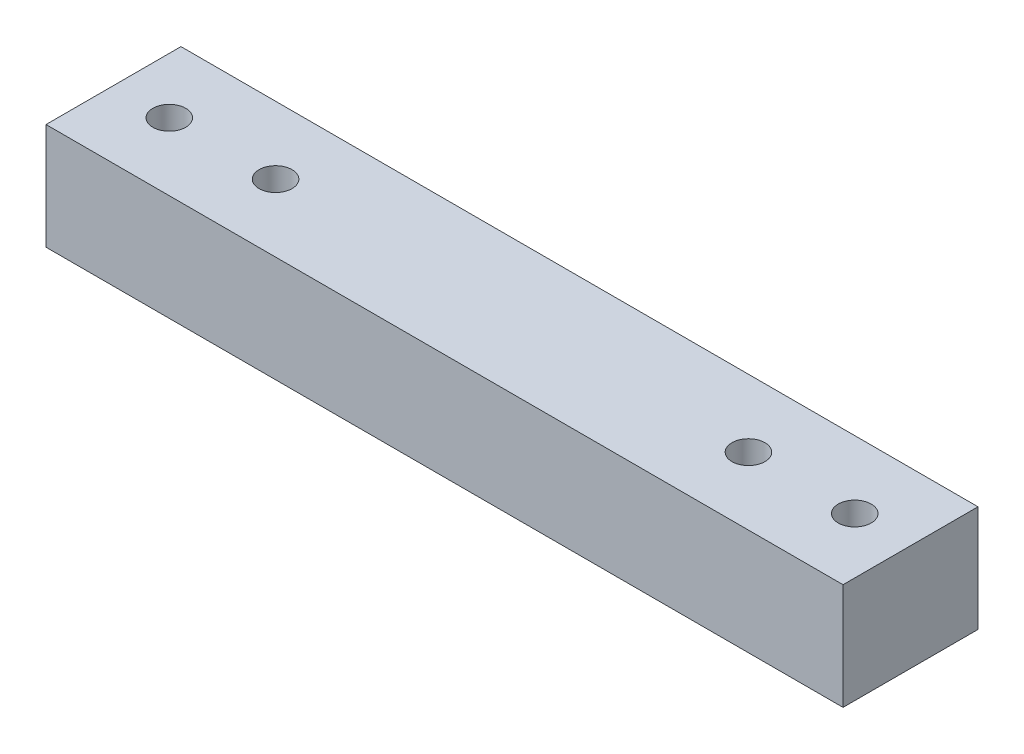
ISO-10303-21;
HEADER;
FILE_DESCRIPTION(('STEP AP214'),'2;1');
FILE_NAME('part.step','',(''),(''),'','','');
FILE_SCHEMA(('AUTOMOTIVE_DESIGN { 1 0 10303 214 1 1 1 1 }'));
ENDSEC;
DATA;
#1=APPLICATION_CONTEXT('core data for automotive mechanical design processes');
#2=APPLICATION_PROTOCOL_DEFINITION('international standard','automotive_design',2000,#1);
#3=PRODUCT_CONTEXT('',#1,'mechanical');
#4=PRODUCT('Part','Part','',(#3));
#5=PRODUCT_RELATED_PRODUCT_CATEGORY('part','',(#4));
#6=PRODUCT_DEFINITION_FORMATION('','',#4);
#7=PRODUCT_DEFINITION_CONTEXT('part definition',#1,'design');
#8=PRODUCT_DEFINITION('design','',#6,#7);
#9=PRODUCT_DEFINITION_SHAPE('','',#8);
#10=(LENGTH_UNIT() NAMED_UNIT(*) SI_UNIT(.MILLI.,.METRE.));
#11=(NAMED_UNIT(*) PLANE_ANGLE_UNIT() SI_UNIT($,.RADIAN.));
#12=(NAMED_UNIT(*) SI_UNIT($,.STERADIAN.) SOLID_ANGLE_UNIT());
#13=UNCERTAINTY_MEASURE_WITH_UNIT(LENGTH_MEASURE(1.E-05),#10,'distance_accuracy_value','');
#14=(GEOMETRIC_REPRESENTATION_CONTEXT(3) GLOBAL_UNCERTAINTY_ASSIGNED_CONTEXT((#13)) GLOBAL_UNIT_ASSIGNED_CONTEXT((#10,
#11,#12)) REPRESENTATION_CONTEXT('',''));
#15=CARTESIAN_POINT('',(0.,0.,0.));
#16=DIRECTION('',(0.,0.,1.));
#17=DIRECTION('',(1.,0.,0.));
#18=AXIS2_PLACEMENT_3D('',#15,#16,#17);
#19=CARTESIAN_POINT('',(37.5,10.,6.35));
#20=DIRECTION('',(-1.,0.,0.));
#21=DIRECTION('',(0.,0.,1.));
#22=AXIS2_PLACEMENT_3D('',#19,#20,#21);
#23=PLANE('',#22);
#24=DIRECTION('',(0.,0.,-1.));
#25=VECTOR('',#24,1.);
#26=CARTESIAN_POINT('',(37.5,0.,6.35));
#27=LINE('',#26,#25);
#28=CARTESIAN_POINT('',(37.5,0.,6.35));
#29=VERTEX_POINT('',#28);
#30=CARTESIAN_POINT('',(37.5,0.,-6.35));
#31=VERTEX_POINT('',#30);
#32=EDGE_CURVE('E107',#29,#31,#27,.T.);
#33=ORIENTED_EDGE('',*,*,#32,.T.);
#34=DIRECTION('',(0.,-1.,0.));
#35=VECTOR('',#34,1.);
#36=CARTESIAN_POINT('',(37.5,10.,-6.35));
#37=LINE('',#36,#35);
#38=CARTESIAN_POINT('',(37.5,10.,-6.35));
#39=VERTEX_POINT('',#38);
#40=EDGE_CURVE('E11',#39,#31,#37,.T.);
#41=ORIENTED_EDGE('',*,*,#40,.F.);
#42=DIRECTION('',(0.,0.,-1.));
#43=VECTOR('',#42,1.);
#44=CARTESIAN_POINT('',(37.5,10.,6.35));
#45=LINE('',#44,#43);
#46=CARTESIAN_POINT('',(37.5,10.,6.35));
#47=VERTEX_POINT('',#46);
#48=EDGE_CURVE('E95',#47,#39,#45,.T.);
#49=ORIENTED_EDGE('',*,*,#48,.F.);
#50=DIRECTION('',(0.,-1.,0.));
#51=VECTOR('',#50,1.);
#52=CARTESIAN_POINT('',(37.5,10.,6.35));
#53=LINE('',#52,#51);
#54=EDGE_CURVE('E103',#47,#29,#53,.T.);
#55=ORIENTED_EDGE('',*,*,#54,.T.);
#56=EDGE_LOOP('',(#33,#41,#49,#55));
#57=FACE_BOUND('',#56,.T.);
#58=ADVANCED_FACE('F44',(#57),#23,.F.);
#59=CARTESIAN_POINT('',(-37.5,10.,-6.35));
#60=DIRECTION('',(0.,0.,1.));
#61=DIRECTION('',(1.,0.,0.));
#62=AXIS2_PLACEMENT_3D('',#59,#60,#61);
#63=PLANE('',#62);
#64=DIRECTION('',(-1.,0.,0.));
#65=VECTOR('',#64,1.);
#66=CARTESIAN_POINT('',(-37.5,0.,-6.35));
#67=LINE('',#66,#65);
#68=CARTESIAN_POINT('',(-37.5,0.,-6.35));
#69=VERTEX_POINT('',#68);
#70=EDGE_CURVE('E99',#31,#69,#67,.T.);
#71=ORIENTED_EDGE('',*,*,#70,.T.);
#72=DIRECTION('',(0.,-1.,0.));
#73=VECTOR('',#72,1.);
#74=CARTESIAN_POINT('',(-37.5,10.,-6.35));
#75=LINE('',#74,#73);
#76=CARTESIAN_POINT('',(-37.5,10.,-6.35));
#77=VERTEX_POINT('',#76);
#78=EDGE_CURVE('E52',#77,#69,#75,.T.);
#79=ORIENTED_EDGE('',*,*,#78,.F.);
#80=DIRECTION('',(-1.,0.,0.));
#81=VECTOR('',#80,1.);
#82=CARTESIAN_POINT('',(-37.5,10.,-6.35));
#83=LINE('',#82,#81);
#84=EDGE_CURVE('E90',#39,#77,#83,.T.);
#85=ORIENTED_EDGE('',*,*,#84,.F.);
#86=ORIENTED_EDGE('',*,*,#40,.T.);
#87=EDGE_LOOP('',(#71,#79,#85,#86));
#88=FACE_BOUND('',#87,.T.);
#89=ADVANCED_FACE('F98',(#88),#63,.F.);
#90=CARTESIAN_POINT('',(-37.5,10.,6.35));
#91=DIRECTION('',(1.,0.,0.));
#92=DIRECTION('',(0.,0.,-1.));
#93=AXIS2_PLACEMENT_3D('',#90,#91,#92);
#94=PLANE('',#93);
#95=DIRECTION('',(0.,0.,1.));
#96=VECTOR('',#95,1.);
#97=CARTESIAN_POINT('',(-37.5,0.,6.35));
#98=LINE('',#97,#96);
#99=CARTESIAN_POINT('',(-37.5,0.,6.35));
#100=VERTEX_POINT('',#99);
#101=EDGE_CURVE('E77',#69,#100,#98,.T.);
#102=ORIENTED_EDGE('',*,*,#101,.T.);
#103=DIRECTION('',(0.,-1.,0.));
#104=VECTOR('',#103,1.);
#105=CARTESIAN_POINT('',(-37.5,10.,6.35));
#106=LINE('',#105,#104);
#107=CARTESIAN_POINT('',(-37.5,10.,6.35));
#108=VERTEX_POINT('',#107);
#109=EDGE_CURVE('E100',#108,#100,#106,.T.);
#110=ORIENTED_EDGE('',*,*,#109,.F.);
#111=DIRECTION('',(0.,0.,1.));
#112=VECTOR('',#111,1.);
#113=CARTESIAN_POINT('',(-37.5,10.,6.35));
#114=LINE('',#113,#112);
#115=EDGE_CURVE('E93',#77,#108,#114,.T.);
#116=ORIENTED_EDGE('',*,*,#115,.F.);
#117=ORIENTED_EDGE('',*,*,#78,.T.);
#118=EDGE_LOOP('',(#102,#110,#116,#117));
#119=FACE_BOUND('',#118,.T.);
#120=ADVANCED_FACE('F101',(#119),#94,.F.);
#121=CARTESIAN_POINT('',(-37.5,10.,6.35));
#122=DIRECTION('',(0.,0.,-1.));
#123=DIRECTION('',(-1.,0.,0.));
#124=AXIS2_PLACEMENT_3D('',#121,#122,#123);
#125=PLANE('',#124);
#126=DIRECTION('',(1.,0.,0.));
#127=VECTOR('',#126,1.);
#128=CARTESIAN_POINT('',(-37.5,0.,6.35));
#129=LINE('',#128,#127);
#130=EDGE_CURVE('E83',#100,#29,#129,.T.);
#131=ORIENTED_EDGE('',*,*,#130,.T.);
#132=ORIENTED_EDGE('',*,*,#54,.F.);
#133=DIRECTION('',(1.,0.,0.));
#134=VECTOR('',#133,1.);
#135=CARTESIAN_POINT('',(-37.5,10.,6.35));
#136=LINE('',#135,#134);
#137=EDGE_CURVE('E60',#108,#47,#136,.T.);
#138=ORIENTED_EDGE('',*,*,#137,.F.);
#139=ORIENTED_EDGE('',*,*,#109,.T.);
#140=EDGE_LOOP('',(#131,#132,#138,#139));
#141=FACE_BOUND('',#140,.T.);
#142=ADVANCED_FACE('F115',(#141),#125,.F.);
#143=CARTESIAN_POINT('',(0.,10.,0.));
#144=DIRECTION('',(0.,-1.,0.));
#145=DIRECTION('',(0.,0.,-1.));
#146=AXIS2_PLACEMENT_3D('',#143,#144,#145);
#147=PLANE('',#146);
#148=CARTESIAN_POINT('',(32.25,10.,0.));
#149=DIRECTION('',(0.,1.,0.));
#150=DIRECTION('',(0.,0.,1.));
#151=AXIS2_PLACEMENT_3D('',#148,#149,#150);
#152=CIRCLE('',#151,1.55);
#153=CARTESIAN_POINT('',(32.25,10.,1.55));
#154=VERTEX_POINT('',#153);
#155=EDGE_CURVE('E134',#154,#154,#152,.T.);
#156=ORIENTED_EDGE('',*,*,#155,.F.);
#157=EDGE_LOOP('',(#156));
#158=FACE_BOUND('',#157,.T.);
#159=CARTESIAN_POINT('',(-22.25,10.,0.));
#160=DIRECTION('',(0.,1.,0.));
#161=DIRECTION('',(0.,0.,-1.));
#162=AXIS2_PLACEMENT_3D('',#159,#160,#161);
#163=CIRCLE('',#162,1.55);
#164=CARTESIAN_POINT('',(-22.25,10.,-1.55));
#165=VERTEX_POINT('',#164);
#166=EDGE_CURVE('E125',#165,#165,#163,.T.);
#167=ORIENTED_EDGE('',*,*,#166,.F.);
#168=EDGE_LOOP('',(#167));
#169=FACE_BOUND('',#168,.T.);
#170=CARTESIAN_POINT('',(-32.25,10.,0.));
#171=DIRECTION('',(0.,1.,0.));
#172=DIRECTION('',(0.,0.,-1.));
#173=AXIS2_PLACEMENT_3D('',#170,#171,#172);
#174=CIRCLE('',#173,1.55);
#175=CARTESIAN_POINT('',(-32.25,10.,-1.55));
#176=VERTEX_POINT('',#175);
#177=EDGE_CURVE('E124',#176,#176,#174,.T.);
#178=ORIENTED_EDGE('',*,*,#177,.F.);
#179=EDGE_LOOP('',(#178));
#180=FACE_BOUND('',#179,.T.);
#181=CARTESIAN_POINT('',(22.25,10.,0.));
#182=DIRECTION('',(0.,1.,0.));
#183=DIRECTION('',(0.,0.,1.));
#184=AXIS2_PLACEMENT_3D('',#181,#182,#183);
#185=CIRCLE('',#184,1.55);
#186=CARTESIAN_POINT('',(22.25,10.,1.55));
#187=VERTEX_POINT('',#186);
#188=EDGE_CURVE('E131',#187,#187,#185,.T.);
#189=ORIENTED_EDGE('',*,*,#188,.F.);
#190=EDGE_LOOP('',(#189));
#191=FACE_BOUND('',#190,.T.);
#192=ORIENTED_EDGE('',*,*,#48,.T.);
#193=ORIENTED_EDGE('',*,*,#84,.T.);
#194=ORIENTED_EDGE('',*,*,#115,.T.);
#195=ORIENTED_EDGE('',*,*,#137,.T.);
#196=EDGE_LOOP('',(#192,#193,#194,#195));
#197=FACE_BOUND('',#196,.T.);
#198=ADVANCED_FACE('F91',(#158,#169,#180,#191,#197),#147,.F.);
#199=CARTESIAN_POINT('',(0.,0.,0.));
#200=DIRECTION('',(0.,-1.,0.));
#201=DIRECTION('',(0.,0.,-1.));
#202=AXIS2_PLACEMENT_3D('',#199,#200,#201);
#203=PLANE('',#202);
#204=CARTESIAN_POINT('',(32.25,0.,0.));
#205=DIRECTION('',(0.,1.,0.));
#206=DIRECTION('',(0.,0.,1.));
#207=AXIS2_PLACEMENT_3D('',#204,#205,#206);
#208=CIRCLE('',#207,1.55);
#209=CARTESIAN_POINT('',(32.25,0.,1.55));
#210=VERTEX_POINT('',#209);
#211=EDGE_CURVE('E110',#210,#210,#208,.T.);
#212=ORIENTED_EDGE('',*,*,#211,.T.);
#213=EDGE_LOOP('',(#212));
#214=FACE_BOUND('',#213,.T.);
#215=CARTESIAN_POINT('',(-22.25,0.,0.));
#216=DIRECTION('',(0.,1.,0.));
#217=DIRECTION('',(0.,0.,-1.));
#218=AXIS2_PLACEMENT_3D('',#215,#216,#217);
#219=CIRCLE('',#218,1.55);
#220=CARTESIAN_POINT('',(-22.25,0.,-1.55));
#221=VERTEX_POINT('',#220);
#222=EDGE_CURVE('E135',#221,#221,#219,.T.);
#223=ORIENTED_EDGE('',*,*,#222,.T.);
#224=EDGE_LOOP('',(#223));
#225=FACE_BOUND('',#224,.T.);
#226=CARTESIAN_POINT('',(-32.25,0.,0.));
#227=DIRECTION('',(0.,1.,0.));
#228=DIRECTION('',(0.,0.,-1.));
#229=AXIS2_PLACEMENT_3D('',#226,#227,#228);
#230=CIRCLE('',#229,1.55);
#231=CARTESIAN_POINT('',(-32.25,0.,-1.55));
#232=VERTEX_POINT('',#231);
#233=EDGE_CURVE('E121',#232,#232,#230,.T.);
#234=ORIENTED_EDGE('',*,*,#233,.T.);
#235=EDGE_LOOP('',(#234));
#236=FACE_BOUND('',#235,.T.);
#237=CARTESIAN_POINT('',(22.25,0.,0.));
#238=DIRECTION('',(0.,1.,0.));
#239=DIRECTION('',(0.,0.,1.));
#240=AXIS2_PLACEMENT_3D('',#237,#238,#239);
#241=CIRCLE('',#240,1.55);
#242=CARTESIAN_POINT('',(22.25,0.,1.55));
#243=VERTEX_POINT('',#242);
#244=EDGE_CURVE('E128',#243,#243,#241,.T.);
#245=ORIENTED_EDGE('',*,*,#244,.T.);
#246=EDGE_LOOP('',(#245));
#247=FACE_BOUND('',#246,.T.);
#248=ORIENTED_EDGE('',*,*,#32,.F.);
#249=ORIENTED_EDGE('',*,*,#130,.F.);
#250=ORIENTED_EDGE('',*,*,#101,.F.);
#251=ORIENTED_EDGE('',*,*,#70,.F.);
#252=EDGE_LOOP('',(#248,#249,#250,#251));
#253=FACE_BOUND('',#252,.T.);
#254=ADVANCED_FACE('F118',(#214,#225,#236,#247,#253),#203,.T.);
#255=CARTESIAN_POINT('',(22.25,0.,0.));
#256=DIRECTION('',(0.,1.,0.));
#257=DIRECTION('',(0.,0.,1.));
#258=AXIS2_PLACEMENT_3D('',#255,#256,#257);
#259=CYLINDRICAL_SURFACE('',#258,1.55);
#260=ORIENTED_EDGE('',*,*,#244,.F.);
#261=EDGE_LOOP('',(#260));
#262=FACE_BOUND('',#261,.T.);
#263=ORIENTED_EDGE('',*,*,#188,.T.);
#264=EDGE_LOOP('',(#263));
#265=FACE_BOUND('',#264,.T.);
#266=ADVANCED_FACE('F163',(#262,#265),#259,.F.);
#267=CARTESIAN_POINT('',(-32.25,0.,0.));
#268=DIRECTION('',(0.,1.,0.));
#269=DIRECTION('',(0.,0.,1.));
#270=AXIS2_PLACEMENT_3D('',#267,#268,#269);
#271=CYLINDRICAL_SURFACE('',#270,1.55);
#272=ORIENTED_EDGE('',*,*,#233,.F.);
#273=EDGE_LOOP('',(#272));
#274=FACE_BOUND('',#273,.T.);
#275=ORIENTED_EDGE('',*,*,#177,.T.);
#276=EDGE_LOOP('',(#275));
#277=FACE_BOUND('',#276,.T.);
#278=ADVANCED_FACE('F165',(#274,#277),#271,.F.);
#279=CARTESIAN_POINT('',(-22.25,0.,0.));
#280=DIRECTION('',(0.,1.,0.));
#281=DIRECTION('',(0.,0.,1.));
#282=AXIS2_PLACEMENT_3D('',#279,#280,#281);
#283=CYLINDRICAL_SURFACE('',#282,1.55);
#284=ORIENTED_EDGE('',*,*,#222,.F.);
#285=EDGE_LOOP('',(#284));
#286=FACE_BOUND('',#285,.T.);
#287=ORIENTED_EDGE('',*,*,#166,.T.);
#288=EDGE_LOOP('',(#287));
#289=FACE_BOUND('',#288,.T.);
#290=ADVANCED_FACE('F150',(#286,#289),#283,.F.);
#291=CARTESIAN_POINT('',(32.25,0.,0.));
#292=DIRECTION('',(0.,1.,0.));
#293=DIRECTION('',(0.,0.,1.));
#294=AXIS2_PLACEMENT_3D('',#291,#292,#293);
#295=CYLINDRICAL_SURFACE('',#294,1.55);
#296=ORIENTED_EDGE('',*,*,#211,.F.);
#297=EDGE_LOOP('',(#296));
#298=FACE_BOUND('',#297,.T.);
#299=ORIENTED_EDGE('',*,*,#155,.T.);
#300=EDGE_LOOP('',(#299));
#301=FACE_BOUND('',#300,.T.);
#302=ADVANCED_FACE('F147',(#298,#301),#295,.F.);
#303=CLOSED_SHELL('',(#58,#89,#120,#142,#198,#254,#266,#278,#290,#302));
#304=MANIFOLD_SOLID_BREP('B2',#303);
#305=ADVANCED_BREP_SHAPE_REPRESENTATION('',(#18,#304),#14);
#306=SHAPE_DEFINITION_REPRESENTATION(#9,#305);
ENDSEC;
END-ISO-10303-21;
